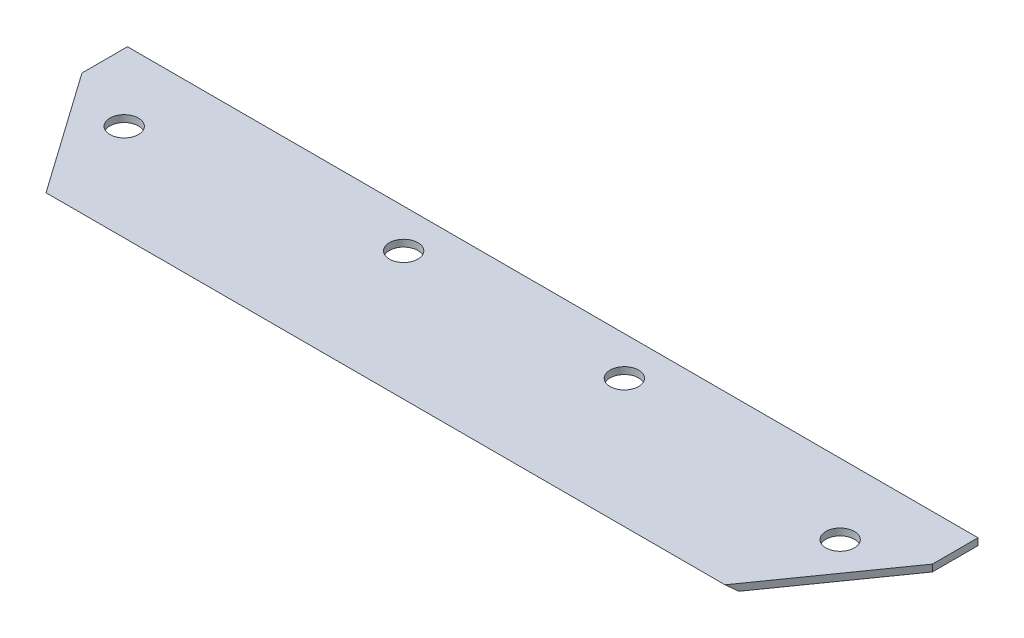
ISO-10303-21;
HEADER;
FILE_DESCRIPTION(('STEP AP214'),'2;1');
FILE_NAME('part.step','',(''),(''),'','','');
FILE_SCHEMA(('AUTOMOTIVE_DESIGN { 1 0 10303 214 1 1 1 1 }'));
ENDSEC;
DATA;
#1=APPLICATION_CONTEXT('core data for automotive mechanical design processes');
#2=APPLICATION_PROTOCOL_DEFINITION('international standard','automotive_design',2000,#1);
#3=PRODUCT_CONTEXT('',#1,'mechanical');
#4=PRODUCT('Part','Part','',(#3));
#5=PRODUCT_RELATED_PRODUCT_CATEGORY('part','',(#4));
#6=PRODUCT_DEFINITION_FORMATION('','',#4);
#7=PRODUCT_DEFINITION_CONTEXT('part definition',#1,'design');
#8=PRODUCT_DEFINITION('design','',#6,#7);
#9=PRODUCT_DEFINITION_SHAPE('','',#8);
#10=(LENGTH_UNIT() NAMED_UNIT(*) SI_UNIT(.MILLI.,.METRE.));
#11=(NAMED_UNIT(*) PLANE_ANGLE_UNIT() SI_UNIT($,.RADIAN.));
#12=(NAMED_UNIT(*) SI_UNIT($,.STERADIAN.) SOLID_ANGLE_UNIT());
#13=UNCERTAINTY_MEASURE_WITH_UNIT(LENGTH_MEASURE(1.E-05),#10,'distance_accuracy_value','');
#14=(GEOMETRIC_REPRESENTATION_CONTEXT(3) GLOBAL_UNCERTAINTY_ASSIGNED_CONTEXT((#13)) GLOBAL_UNIT_ASSIGNED_CONTEXT((#10,
#11,#12)) REPRESENTATION_CONTEXT('',''));
#15=CARTESIAN_POINT('',(0.,0.,0.));
#16=DIRECTION('',(0.,0.,1.));
#17=DIRECTION('',(1.,0.,0.));
#18=AXIS2_PLACEMENT_3D('',#15,#16,#17);
#19=CARTESIAN_POINT('',(79.,1.27,21.75));
#20=DIRECTION('',(-1.,0.,0.));
#21=DIRECTION('',(0.,0.,1.));
#22=AXIS2_PLACEMENT_3D('',#19,#20,#21);
#23=PLANE('',#22);
#24=DIRECTION('',(0.,0.,-1.));
#25=VECTOR('',#24,1.);
#26=CARTESIAN_POINT('',(79.,1.27,21.75));
#27=LINE('',#26,#25);
#28=CARTESIAN_POINT('',(79.,1.27,-13.2888427681154));
#29=VERTEX_POINT('',#28);
#30=CARTESIAN_POINT('',(79.,1.27,-21.75));
#31=VERTEX_POINT('',#30);
#32=EDGE_CURVE('E93',#29,#31,#27,.T.);
#33=ORIENTED_EDGE('',*,*,#32,.F.);
#34=DIRECTION('',(0.,-1.,0.));
#35=VECTOR('',#34,1.);
#36=CARTESIAN_POINT('',(79.,1.27,-13.2888427681154));
#37=LINE('',#36,#35);
#38=CARTESIAN_POINT('',(79.,0.,-13.2888427681154));
#39=VERTEX_POINT('',#38);
#40=EDGE_CURVE('E82',#29,#39,#37,.T.);
#41=ORIENTED_EDGE('',*,*,#40,.T.);
#42=DIRECTION('',(0.,0.,-1.));
#43=VECTOR('',#42,1.);
#44=CARTESIAN_POINT('',(79.,0.,21.75));
#45=LINE('',#44,#43);
#46=CARTESIAN_POINT('',(79.,0.,-21.75));
#47=VERTEX_POINT('',#46);
#48=EDGE_CURVE('E116',#39,#47,#45,.T.);
#49=ORIENTED_EDGE('',*,*,#48,.T.);
#50=DIRECTION('',(0.,-1.,0.));
#51=VECTOR('',#50,1.);
#52=CARTESIAN_POINT('',(79.,1.27,-21.75));
#53=LINE('',#52,#51);
#54=EDGE_CURVE('E101',#31,#47,#53,.T.);
#55=ORIENTED_EDGE('',*,*,#54,.F.);
#56=EDGE_LOOP('',(#33,#41,#49,#55));
#57=FACE_BOUND('',#56,.T.);
#58=ADVANCED_FACE('F33',(#57),#23,.F.);
#59=CARTESIAN_POINT('',(-79.,1.27,-21.75));
#60=DIRECTION('',(0.,0.,1.));
#61=DIRECTION('',(1.,0.,0.));
#62=AXIS2_PLACEMENT_3D('',#59,#60,#61);
#63=PLANE('',#62);
#64=DIRECTION('',(-1.,0.,0.));
#65=VECTOR('',#64,1.);
#66=CARTESIAN_POINT('',(-79.,0.,-21.75));
#67=LINE('',#66,#65);
#68=CARTESIAN_POINT('',(-79.,0.,-21.75));
#69=VERTEX_POINT('',#68);
#70=EDGE_CURVE('E108',#47,#69,#67,.T.);
#71=ORIENTED_EDGE('',*,*,#70,.T.);
#72=DIRECTION('',(0.,-1.,0.));
#73=VECTOR('',#72,1.);
#74=CARTESIAN_POINT('',(-79.,1.27,-21.75));
#75=LINE('',#74,#73);
#76=CARTESIAN_POINT('',(-79.,1.27,-21.75));
#77=VERTEX_POINT('',#76);
#78=EDGE_CURVE('E115',#77,#69,#75,.T.);
#79=ORIENTED_EDGE('',*,*,#78,.F.);
#80=DIRECTION('',(-1.,0.,0.));
#81=VECTOR('',#80,1.);
#82=CARTESIAN_POINT('',(-79.,1.27,-21.75));
#83=LINE('',#82,#81);
#84=EDGE_CURVE('E102',#31,#77,#83,.T.);
#85=ORIENTED_EDGE('',*,*,#84,.F.);
#86=ORIENTED_EDGE('',*,*,#54,.T.);
#87=EDGE_LOOP('',(#71,#79,#85,#86));
#88=FACE_BOUND('',#87,.T.);
#89=ADVANCED_FACE('F180',(#88),#63,.F.);
#90=CARTESIAN_POINT('',(-79.,1.27,21.75));
#91=DIRECTION('',(1.,0.,0.));
#92=DIRECTION('',(0.,0.,-1.));
#93=AXIS2_PLACEMENT_3D('',#90,#91,#92);
#94=PLANE('',#93);
#95=DIRECTION('',(0.,0.,1.));
#96=VECTOR('',#95,1.);
#97=CARTESIAN_POINT('',(-79.,0.,21.75));
#98=LINE('',#97,#96);
#99=CARTESIAN_POINT('',(-79.,0.,-13.2888427681155));
#100=VERTEX_POINT('',#99);
#101=EDGE_CURVE('E103',#69,#100,#98,.T.);
#102=ORIENTED_EDGE('',*,*,#101,.T.);
#103=DIRECTION('',(0.,-1.,0.));
#104=VECTOR('',#103,1.);
#105=CARTESIAN_POINT('',(-79.,1.27,-13.2888427681155));
#106=LINE('',#105,#104);
#107=CARTESIAN_POINT('',(-79.,1.27,-13.2888427681155));
#108=VERTEX_POINT('',#107);
#109=EDGE_CURVE('E136',#108,#100,#106,.T.);
#110=ORIENTED_EDGE('',*,*,#109,.F.);
#111=DIRECTION('',(0.,0.,1.));
#112=VECTOR('',#111,1.);
#113=CARTESIAN_POINT('',(-79.,1.27,21.75));
#114=LINE('',#113,#112);
#115=EDGE_CURVE('E105',#77,#108,#114,.T.);
#116=ORIENTED_EDGE('',*,*,#115,.F.);
#117=ORIENTED_EDGE('',*,*,#78,.T.);
#118=EDGE_LOOP('',(#102,#110,#116,#117));
#119=FACE_BOUND('',#118,.T.);
#120=ADVANCED_FACE('F172',(#119),#94,.F.);
#121=CARTESIAN_POINT('',(0.,1.27,0.));
#122=DIRECTION('',(0.,-1.,0.));
#123=DIRECTION('',(0.,0.,-1.));
#124=AXIS2_PLACEMENT_3D('',#121,#122,#123);
#125=PLANE('',#124);
#126=CARTESIAN_POINT('',(-66.5,1.27,-8.63918542133545));
#127=DIRECTION('',(0.,1.,0.));
#128=DIRECTION('',(0.,0.,1.));
#129=AXIS2_PLACEMENT_3D('',#126,#127,#128);
#130=CIRCLE('',#129,2.64999999999999);
#131=CARTESIAN_POINT('',(-66.5,1.27,-5.98918542133546));
#132=VERTEX_POINT('',#131);
#133=EDGE_CURVE('E139',#132,#132,#130,.T.);
#134=ORIENTED_EDGE('',*,*,#133,.F.);
#135=EDGE_LOOP('',(#134));
#136=FACE_BOUND('',#135,.T.);
#137=CARTESIAN_POINT('',(-20.5,1.27,-14.5554072893322));
#138=DIRECTION('',(0.,1.,0.));
#139=DIRECTION('',(0.,0.,1.));
#140=AXIS2_PLACEMENT_3D('',#137,#138,#139);
#141=CIRCLE('',#140,2.64999999999999);
#142=CARTESIAN_POINT('',(-20.5,1.27,-11.9054072893323));
#143=VERTEX_POINT('',#142);
#144=EDGE_CURVE('E145',#143,#143,#141,.T.);
#145=ORIENTED_EDGE('',*,*,#144,.F.);
#146=EDGE_LOOP('',(#145));
#147=FACE_BOUND('',#146,.T.);
#148=CARTESIAN_POINT('',(20.5,1.27,-14.5554072893323));
#149=DIRECTION('',(0.,1.,0.));
#150=DIRECTION('',(0.,0.,1.));
#151=AXIS2_PLACEMENT_3D('',#148,#149,#150);
#152=CIRCLE('',#151,2.64999999999999);
#153=CARTESIAN_POINT('',(20.5,1.27,-11.9054072893323));
#154=VERTEX_POINT('',#153);
#155=EDGE_CURVE('E151',#154,#154,#152,.T.);
#156=ORIENTED_EDGE('',*,*,#155,.F.);
#157=EDGE_LOOP('',(#156));
#158=FACE_BOUND('',#157,.T.);
#159=CARTESIAN_POINT('',(66.5,1.27,-8.63918542133547));
#160=DIRECTION('',(0.,1.,0.));
#161=DIRECTION('',(0.,0.,1.));
#162=AXIS2_PLACEMENT_3D('',#159,#160,#161);
#163=CIRCLE('',#162,2.64999999999999);
#164=CARTESIAN_POINT('',(66.5,1.27,-5.98918542133548));
#165=VERTEX_POINT('',#164);
#166=EDGE_CURVE('E157',#165,#165,#163,.T.);
#167=ORIENTED_EDGE('',*,*,#166,.F.);
#168=EDGE_LOOP('',(#167));
#169=FACE_BOUND('',#168,.T.);
#170=DIRECTION('',(1.,0.,0.));
#171=VECTOR('',#170,1.);
#172=CARTESIAN_POINT('',(0.,1.27,9.31633910853961));
#173=LINE('',#172,#171);
#174=CARTESIAN_POINT('',(-63.0699651602873,1.27,9.31633910853961));
#175=VERTEX_POINT('',#174);
#176=CARTESIAN_POINT('',(63.0699651602873,1.27,9.31633910853961));
#177=VERTEX_POINT('',#176);
#178=EDGE_CURVE('E97',#175,#177,#173,.T.);
#179=ORIENTED_EDGE('',*,*,#178,.T.);
#180=DIRECTION('',(0.576041894714167,0.,-0.817420170740919));
#181=VECTOR('',#180,1.);
#182=CARTESIAN_POINT('',(79.,1.27,-13.2888427681154));
#183=LINE('',#182,#181);
#184=EDGE_CURVE('E47',#177,#29,#183,.T.);
#185=ORIENTED_EDGE('',*,*,#184,.T.);
#186=ORIENTED_EDGE('',*,*,#32,.T.);
#187=ORIENTED_EDGE('',*,*,#84,.T.);
#188=ORIENTED_EDGE('',*,*,#115,.T.);
#189=DIRECTION('',(0.576041894714167,0.,0.817420170740919));
#190=VECTOR('',#189,1.);
#191=CARTESIAN_POINT('',(-79.,1.27,-13.2888427681155));
#192=LINE('',#191,#190);
#193=EDGE_CURVE('E134',#108,#175,#192,.T.);
#194=ORIENTED_EDGE('',*,*,#193,.T.);
#195=EDGE_LOOP('',(#179,#185,#186,#187,#188,#194));
#196=FACE_BOUND('',#195,.T.);
#197=ADVANCED_FACE('F92',(#136,#147,#158,#169,#196),#125,.F.);
#198=CARTESIAN_POINT('',(0.,0.,0.));
#199=DIRECTION('',(0.,-1.,0.));
#200=DIRECTION('',(0.,0.,-1.));
#201=AXIS2_PLACEMENT_3D('',#198,#199,#200);
#202=PLANE('',#201);
#203=DIRECTION('',(0.576041894714167,0.,-0.817420170740919));
#204=VECTOR('',#203,1.);
#205=CARTESIAN_POINT('',(64.1365586064069,0.,7.80281204594494));
#206=LINE('',#205,#204);
#207=CARTESIAN_POINT('',(64.1365586064069,0.,7.80281204594494));
#208=VERTEX_POINT('',#207);
#209=EDGE_CURVE('E85',#208,#39,#206,.T.);
#210=ORIENTED_EDGE('',*,*,#209,.F.);
#211=DIRECTION('',(1.,0.,0.));
#212=VECTOR('',#211,1.);
#213=CARTESIAN_POINT('',(0.,0.,7.80281204594494));
#214=LINE('',#213,#212);
#215=CARTESIAN_POINT('',(-64.1365586064069,0.,7.80281204594494));
#216=VERTEX_POINT('',#215);
#217=EDGE_CURVE('E122',#216,#208,#214,.T.);
#218=ORIENTED_EDGE('',*,*,#217,.F.);
#219=DIRECTION('',(0.576041894714167,0.,0.817420170740919));
#220=VECTOR('',#219,1.);
#221=CARTESIAN_POINT('',(-64.1365586064069,0.,7.80281204594494));
#222=LINE('',#221,#220);
#223=EDGE_CURVE('E54',#100,#216,#222,.T.);
#224=ORIENTED_EDGE('',*,*,#223,.F.);
#225=ORIENTED_EDGE('',*,*,#101,.F.);
#226=ORIENTED_EDGE('',*,*,#70,.F.);
#227=ORIENTED_EDGE('',*,*,#48,.F.);
#228=EDGE_LOOP('',(#210,#218,#224,#225,#226,#227));
#229=FACE_BOUND('',#228,.T.);
#230=CARTESIAN_POINT('',(-66.5,0.,-8.63918542133545));
#231=DIRECTION('',(0.,1.,0.));
#232=DIRECTION('',(0.,0.,1.));
#233=AXIS2_PLACEMENT_3D('',#230,#231,#232);
#234=CIRCLE('',#233,2.65);
#235=CARTESIAN_POINT('',(-66.5,0.,-5.98918542133545));
#236=VERTEX_POINT('',#235);
#237=EDGE_CURVE('E142',#236,#236,#234,.T.);
#238=ORIENTED_EDGE('',*,*,#237,.T.);
#239=EDGE_LOOP('',(#238));
#240=FACE_BOUND('',#239,.T.);
#241=CARTESIAN_POINT('',(-20.5,0.,-14.5554072893322));
#242=DIRECTION('',(0.,1.,0.));
#243=DIRECTION('',(0.,0.,1.));
#244=AXIS2_PLACEMENT_3D('',#241,#242,#243);
#245=CIRCLE('',#244,2.65);
#246=CARTESIAN_POINT('',(-20.5,0.,-11.9054072893322));
#247=VERTEX_POINT('',#246);
#248=EDGE_CURVE('E148',#247,#247,#245,.T.);
#249=ORIENTED_EDGE('',*,*,#248,.T.);
#250=EDGE_LOOP('',(#249));
#251=FACE_BOUND('',#250,.T.);
#252=CARTESIAN_POINT('',(20.5,0.,-14.5554072893323));
#253=DIRECTION('',(0.,1.,0.));
#254=DIRECTION('',(0.,0.,1.));
#255=AXIS2_PLACEMENT_3D('',#252,#253,#254);
#256=CIRCLE('',#255,2.65);
#257=CARTESIAN_POINT('',(20.5,0.,-11.9054072893323));
#258=VERTEX_POINT('',#257);
#259=EDGE_CURVE('E154',#258,#258,#256,.T.);
#260=ORIENTED_EDGE('',*,*,#259,.T.);
#261=EDGE_LOOP('',(#260));
#262=FACE_BOUND('',#261,.T.);
#263=CARTESIAN_POINT('',(66.5,0.,-8.63918542133547));
#264=DIRECTION('',(0.,1.,0.));
#265=DIRECTION('',(0.,0.,1.));
#266=AXIS2_PLACEMENT_3D('',#263,#264,#265);
#267=CIRCLE('',#266,2.65);
#268=CARTESIAN_POINT('',(66.5,0.,-5.98918542133547));
#269=VERTEX_POINT('',#268);
#270=EDGE_CURVE('E159',#269,#269,#267,.T.);
#271=ORIENTED_EDGE('',*,*,#270,.T.);
#272=EDGE_LOOP('',(#271));
#273=FACE_BOUND('',#272,.T.);
#274=ADVANCED_FACE('F128',(#229,#240,#251,#262,#273),#202,.T.);
#275=CARTESIAN_POINT('',(-79.,-1.62079439814578,5.87122449909811));
#276=DIRECTION('',(0.,0.766044443118982,-0.642787609686534));
#277=DIRECTION('',(0.,0.642787609686534,0.766044443118982));
#278=AXIS2_PLACEMENT_3D('',#275,#276,#277);
#279=PLANE('',#278);
#280=ORIENTED_EDGE('',*,*,#217,.T.);
#281=DIRECTION('',(-0.475037892392385,0.565630817940259,0.674092559362314));
#282=VECTOR('',#281,1.);
#283=CARTESIAN_POINT('',(32.8902528709186,37.2051866889324,52.142226945619));
#284=LINE('',#283,#282);
#285=EDGE_CURVE('E11',#208,#177,#284,.T.);
#286=ORIENTED_EDGE('',*,*,#285,.T.);
#287=ORIENTED_EDGE('',*,*,#178,.F.);
#288=DIRECTION('',(-0.475037892392385,-0.565630817940259,-0.674092559362314));
#289=VECTOR('',#288,1.);
#290=CARTESIAN_POINT('',(-68.5446907458772,-5.248792628058,1.54754457467472));
#291=LINE('',#290,#289);
#292=EDGE_CURVE('E40',#175,#216,#291,.T.);
#293=ORIENTED_EDGE('',*,*,#292,.T.);
#294=EDGE_LOOP('',(#280,#286,#287,#293));
#295=FACE_BOUND('',#294,.T.);
#296=ADVANCED_FACE('F126',(#295),#279,.F.);
#297=CARTESIAN_POINT('',(66.5,1.27,-8.63918542133547));
#298=DIRECTION('',(0.,1.,0.));
#299=DIRECTION('',(0.,0.,1.));
#300=AXIS2_PLACEMENT_3D('',#297,#298,#299);
#301=CYLINDRICAL_SURFACE('',#300,2.64999999999999);
#302=ORIENTED_EDGE('',*,*,#270,.F.);
#303=EDGE_LOOP('',(#302));
#304=FACE_BOUND('',#303,.T.);
#305=ORIENTED_EDGE('',*,*,#166,.T.);
#306=EDGE_LOOP('',(#305));
#307=FACE_BOUND('',#306,.T.);
#308=ADVANCED_FACE('F164',(#304,#307),#301,.F.);
#309=CARTESIAN_POINT('',(20.5,1.27,-14.5554072893323));
#310=DIRECTION('',(0.,1.,0.));
#311=DIRECTION('',(0.,0.,1.));
#312=AXIS2_PLACEMENT_3D('',#309,#310,#311);
#313=CYLINDRICAL_SURFACE('',#312,2.64999999999999);
#314=ORIENTED_EDGE('',*,*,#259,.F.);
#315=EDGE_LOOP('',(#314));
#316=FACE_BOUND('',#315,.T.);
#317=ORIENTED_EDGE('',*,*,#155,.T.);
#318=EDGE_LOOP('',(#317));
#319=FACE_BOUND('',#318,.T.);
#320=ADVANCED_FACE('F167',(#316,#319),#313,.F.);
#321=CARTESIAN_POINT('',(-20.5,1.27,-14.5554072893322));
#322=DIRECTION('',(0.,1.,0.));
#323=DIRECTION('',(0.,0.,1.));
#324=AXIS2_PLACEMENT_3D('',#321,#322,#323);
#325=CYLINDRICAL_SURFACE('',#324,2.64999999999999);
#326=ORIENTED_EDGE('',*,*,#248,.F.);
#327=EDGE_LOOP('',(#326));
#328=FACE_BOUND('',#327,.T.);
#329=ORIENTED_EDGE('',*,*,#144,.T.);
#330=EDGE_LOOP('',(#329));
#331=FACE_BOUND('',#330,.T.);
#332=ADVANCED_FACE('F205',(#328,#331),#325,.F.);
#333=CARTESIAN_POINT('',(-66.5,1.27,-8.63918542133545));
#334=DIRECTION('',(0.,1.,0.));
#335=DIRECTION('',(0.,0.,1.));
#336=AXIS2_PLACEMENT_3D('',#333,#334,#335);
#337=CYLINDRICAL_SURFACE('',#336,2.64999999999999);
#338=ORIENTED_EDGE('',*,*,#237,.F.);
#339=EDGE_LOOP('',(#338));
#340=FACE_BOUND('',#339,.T.);
#341=ORIENTED_EDGE('',*,*,#133,.T.);
#342=EDGE_LOOP('',(#341));
#343=FACE_BOUND('',#342,.T.);
#344=ADVANCED_FACE('F198',(#340,#343),#337,.F.);
#345=CARTESIAN_POINT('',(-64.1365586064069,1.27,7.80281204594494));
#346=DIRECTION('',(0.817420170740919,0.,-0.576041894714167));
#347=DIRECTION('',(-0.576041894714167,0.,-0.817420170740919));
#348=AXIS2_PLACEMENT_3D('',#345,#346,#347);
#349=PLANE('',#348);
#350=ORIENTED_EDGE('',*,*,#193,.F.);
#351=ORIENTED_EDGE('',*,*,#109,.T.);
#352=ORIENTED_EDGE('',*,*,#223,.T.);
#353=ORIENTED_EDGE('',*,*,#292,.F.);
#354=EDGE_LOOP('',(#350,#351,#352,#353));
#355=FACE_BOUND('',#354,.T.);
#356=ADVANCED_FACE('F196',(#355),#349,.F.);
#357=CARTESIAN_POINT('',(64.1365586064069,1.27,7.80281204594494));
#358=DIRECTION('',(-0.817420170740919,0.,-0.576041894714167));
#359=DIRECTION('',(-0.576041894714167,0.,0.817420170740919));
#360=AXIS2_PLACEMENT_3D('',#357,#358,#359);
#361=PLANE('',#360);
#362=ORIENTED_EDGE('',*,*,#209,.T.);
#363=ORIENTED_EDGE('',*,*,#40,.F.);
#364=ORIENTED_EDGE('',*,*,#184,.F.);
#365=ORIENTED_EDGE('',*,*,#285,.F.);
#366=EDGE_LOOP('',(#362,#363,#364,#365));
#367=FACE_BOUND('',#366,.T.);
#368=ADVANCED_FACE('F83',(#367),#361,.F.);
#369=CLOSED_SHELL('',(#58,#89,#120,#197,#274,#296,#308,#320,#332,#344,#356,#368));
#370=MANIFOLD_SOLID_BREP('B2',#369);
#371=ADVANCED_BREP_SHAPE_REPRESENTATION('',(#18,#370),#14);
#372=SHAPE_DEFINITION_REPRESENTATION(#9,#371);
ENDSEC;
END-ISO-10303-21;
